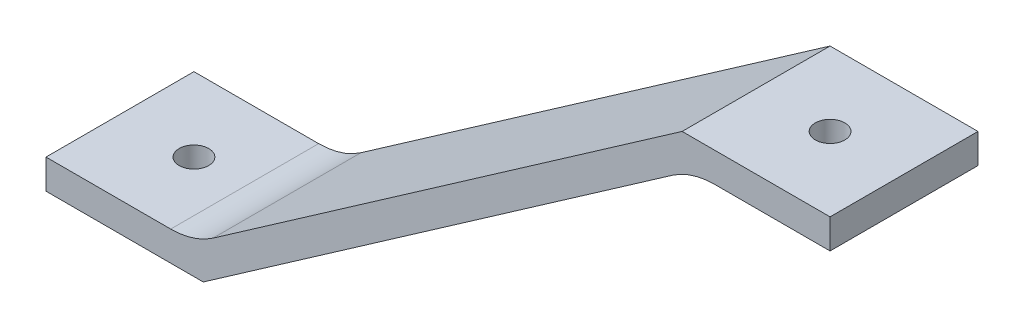
ISO-10303-21;
HEADER;
FILE_DESCRIPTION(('STEP AP214'),'2;1');
FILE_NAME('part.step','',(''),(''),'','','');
FILE_SCHEMA(('AUTOMOTIVE_DESIGN { 1 0 10303 214 1 1 1 1 }'));
ENDSEC;
DATA;
#1=APPLICATION_CONTEXT('core data for automotive mechanical design processes');
#2=APPLICATION_PROTOCOL_DEFINITION('international standard','automotive_design',2000,#1);
#3=PRODUCT_CONTEXT('',#1,'mechanical');
#4=PRODUCT('Part','Part','',(#3));
#5=PRODUCT_RELATED_PRODUCT_CATEGORY('part','',(#4));
#6=PRODUCT_DEFINITION_FORMATION('','',#4);
#7=PRODUCT_DEFINITION_CONTEXT('part definition',#1,'design');
#8=PRODUCT_DEFINITION('design','',#6,#7);
#9=PRODUCT_DEFINITION_SHAPE('','',#8);
#10=(LENGTH_UNIT() NAMED_UNIT(*) SI_UNIT(.MILLI.,.METRE.));
#11=(NAMED_UNIT(*) PLANE_ANGLE_UNIT() SI_UNIT($,.RADIAN.));
#12=(NAMED_UNIT(*) SI_UNIT($,.STERADIAN.) SOLID_ANGLE_UNIT());
#13=UNCERTAINTY_MEASURE_WITH_UNIT(LENGTH_MEASURE(1.E-05),#10,'distance_accuracy_value','');
#14=(GEOMETRIC_REPRESENTATION_CONTEXT(3) GLOBAL_UNCERTAINTY_ASSIGNED_CONTEXT((#13)) GLOBAL_UNIT_ASSIGNED_CONTEXT((#10,
#11,#12)) REPRESENTATION_CONTEXT('',''));
#15=CARTESIAN_POINT('',(0.,0.,0.));
#16=DIRECTION('',(0.,0.,1.));
#17=DIRECTION('',(1.,0.,0.));
#18=AXIS2_PLACEMENT_3D('',#15,#16,#17);
#19=CARTESIAN_POINT('',(-20.,0.,20.));
#20=DIRECTION('',(0.,-1.,0.));
#21=DIRECTION('',(0.,0.,-1.));
#22=AXIS2_PLACEMENT_3D('',#19,#20,#21);
#23=PLANE('',#22);
#24=CARTESIAN_POINT('',(-10.,0.,10.));
#25=DIRECTION('',(0.,1.,0.));
#26=DIRECTION('',(0.,0.,1.));
#27=AXIS2_PLACEMENT_3D('',#24,#25,#26);
#28=CIRCLE('',#27,2.);
#29=CARTESIAN_POINT('',(-10.,0.,12.));
#30=VERTEX_POINT('',#29);
#31=EDGE_CURVE('E148',#30,#30,#28,.T.);
#32=ORIENTED_EDGE('',*,*,#31,.F.);
#33=EDGE_LOOP('',(#32));
#34=FACE_BOUND('',#33,.T.);
#35=DIRECTION('',(-1.,0.,0.));
#36=VECTOR('',#35,1.);
#37=CARTESIAN_POINT('',(-20.,0.,0.));
#38=LINE('',#37,#36);
#39=CARTESIAN_POINT('',(0.,0.,0.));
#40=VERTEX_POINT('',#39);
#41=CARTESIAN_POINT('',(-20.,0.,0.));
#42=VERTEX_POINT('',#41);
#43=EDGE_CURVE('E135',#40,#42,#38,.T.);
#44=ORIENTED_EDGE('',*,*,#43,.T.);
#45=DIRECTION('',(0.,0.,-1.));
#46=VECTOR('',#45,1.);
#47=CARTESIAN_POINT('',(-20.,0.,20.));
#48=LINE('',#47,#46);
#49=CARTESIAN_POINT('',(-20.,0.,20.));
#50=VERTEX_POINT('',#49);
#51=EDGE_CURVE('E116',#50,#42,#48,.T.);
#52=ORIENTED_EDGE('',*,*,#51,.F.);
#53=DIRECTION('',(-1.,0.,0.));
#54=VECTOR('',#53,1.);
#55=CARTESIAN_POINT('',(-20.,0.,20.));
#56=LINE('',#55,#54);
#57=CARTESIAN_POINT('',(0.,0.,20.));
#58=VERTEX_POINT('',#57);
#59=EDGE_CURVE('E123',#58,#50,#56,.T.);
#60=ORIENTED_EDGE('',*,*,#59,.F.);
#61=DIRECTION('',(0.,0.,-1.));
#62=VECTOR('',#61,1.);
#63=CARTESIAN_POINT('',(0.,0.,20.));
#64=LINE('',#63,#62);
#65=EDGE_CURVE('E187',#58,#40,#64,.T.);
#66=ORIENTED_EDGE('',*,*,#65,.T.);
#67=EDGE_LOOP('',(#44,#52,#60,#66));
#68=FACE_BOUND('',#67,.T.);
#69=ADVANCED_FACE('F34',(#34,#68),#23,.F.);
#70=CARTESIAN_POINT('',(-86.,-46.,20.));
#71=DIRECTION('',(0.571792661688173,-0.820398166769987,0.));
#72=DIRECTION('',(0.820398166769987,0.571792661688173,0.));
#73=AXIS2_PLACEMENT_3D('',#70,#71,#72);
#74=PLANE('',#73);
#75=DIRECTION('',(-0.820398166769987,-0.571792661688173,0.));
#76=VECTOR('',#75,1.);
#77=CARTESIAN_POINT('',(-86.,-46.,0.));
#78=LINE('',#77,#76);
#79=CARTESIAN_POINT('',(-83.4231041319172,-44.2039816676998,0.));
#80=VERTEX_POINT('',#79);
#81=EDGE_CURVE('E170',#42,#80,#78,.T.);
#82=ORIENTED_EDGE('',*,*,#81,.T.);
#83=DIRECTION('',(0.,0.,-1.));
#84=VECTOR('',#83,1.);
#85=CARTESIAN_POINT('',(-83.4231041319172,-44.2039816676998,20.));
#86=LINE('',#85,#84);
#87=CARTESIAN_POINT('',(-83.4231041319172,-44.2039816676998,20.));
#88=VERTEX_POINT('',#87);
#89=EDGE_CURVE('E119',#80,#88,#86,.F.);
#90=ORIENTED_EDGE('',*,*,#89,.T.);
#91=DIRECTION('',(-0.820398166769987,-0.571792661688173,0.));
#92=VECTOR('',#91,1.);
#93=CARTESIAN_POINT('',(-86.,-46.,20.));
#94=LINE('',#93,#92);
#95=EDGE_CURVE('E111',#50,#88,#94,.T.);
#96=ORIENTED_EDGE('',*,*,#95,.F.);
#97=ORIENTED_EDGE('',*,*,#51,.T.);
#98=EDGE_LOOP('',(#82,#90,#96,#97));
#99=FACE_BOUND('',#98,.T.);
#100=ADVANCED_FACE('F114',(#99),#74,.F.);
#101=CARTESIAN_POINT('',(-106.,-46.,20.));
#102=DIRECTION('',(0.,-1.,0.));
#103=DIRECTION('',(1.,0.,0.));
#104=AXIS2_PLACEMENT_3D('',#101,#102,#103);
#105=PLANE('',#104);
#106=CARTESIAN_POINT('',(-96.,-46.,10.));
#107=DIRECTION('',(0.,-1.,0.));
#108=DIRECTION('',(1.,0.,0.));
#109=AXIS2_PLACEMENT_3D('',#106,#107,#108);
#110=CIRCLE('',#109,2.);
#111=CARTESIAN_POINT('',(-94.,-46.,10.));
#112=VERTEX_POINT('',#111);
#113=EDGE_CURVE('E220',#112,#112,#110,.T.);
#114=ORIENTED_EDGE('',*,*,#113,.T.);
#115=EDGE_LOOP('',(#114));
#116=FACE_BOUND('',#115,.T.);
#117=DIRECTION('',(-1.,0.,0.));
#118=VECTOR('',#117,1.);
#119=CARTESIAN_POINT('',(-106.,-46.,20.));
#120=LINE('',#119,#118);
#121=CARTESIAN_POINT('',(-89.1410307487989,-46.,20.));
#122=VERTEX_POINT('',#121);
#123=CARTESIAN_POINT('',(-106.,-46.,20.));
#124=VERTEX_POINT('',#123);
#125=EDGE_CURVE('E122',#122,#124,#120,.T.);
#126=ORIENTED_EDGE('',*,*,#125,.F.);
#127=DIRECTION('',(0.,0.,-1.));
#128=VECTOR('',#127,1.);
#129=CARTESIAN_POINT('',(-89.1410307487989,-46.,0.));
#130=LINE('',#129,#128);
#131=CARTESIAN_POINT('',(-89.1410307487989,-46.,0.));
#132=VERTEX_POINT('',#131);
#133=EDGE_CURVE('E136',#122,#132,#130,.T.);
#134=ORIENTED_EDGE('',*,*,#133,.T.);
#135=DIRECTION('',(-1.,0.,0.));
#136=VECTOR('',#135,1.);
#137=CARTESIAN_POINT('',(-106.,-46.,0.));
#138=LINE('',#137,#136);
#139=CARTESIAN_POINT('',(-106.,-46.,0.));
#140=VERTEX_POINT('',#139);
#141=EDGE_CURVE('E172',#132,#140,#138,.T.);
#142=ORIENTED_EDGE('',*,*,#141,.T.);
#143=DIRECTION('',(0.,0.,-1.));
#144=VECTOR('',#143,1.);
#145=CARTESIAN_POINT('',(-106.,-46.,20.));
#146=LINE('',#145,#144);
#147=EDGE_CURVE('E137',#124,#140,#146,.T.);
#148=ORIENTED_EDGE('',*,*,#147,.F.);
#149=EDGE_LOOP('',(#126,#134,#142,#148));
#150=FACE_BOUND('',#149,.T.);
#151=ADVANCED_FACE('F163',(#116,#150),#105,.F.);
#152=CARTESIAN_POINT('',(-106.,-50.,20.));
#153=DIRECTION('',(1.,0.,0.));
#154=DIRECTION('',(0.,1.,0.));
#155=AXIS2_PLACEMENT_3D('',#152,#153,#154);
#156=PLANE('',#155);
#157=DIRECTION('',(0.,-1.,0.));
#158=VECTOR('',#157,1.);
#159=CARTESIAN_POINT('',(-106.,-50.,0.));
#160=LINE('',#159,#158);
#161=CARTESIAN_POINT('',(-106.,-50.,0.));
#162=VERTEX_POINT('',#161);
#163=EDGE_CURVE('E174',#140,#162,#160,.T.);
#164=ORIENTED_EDGE('',*,*,#163,.T.);
#165=DIRECTION('',(0.,0.,-1.));
#166=VECTOR('',#165,1.);
#167=CARTESIAN_POINT('',(-106.,-50.,20.));
#168=LINE('',#167,#166);
#169=CARTESIAN_POINT('',(-106.,-50.,20.));
#170=VERTEX_POINT('',#169);
#171=EDGE_CURVE('E142',#170,#162,#168,.T.);
#172=ORIENTED_EDGE('',*,*,#171,.F.);
#173=DIRECTION('',(0.,-1.,0.));
#174=VECTOR('',#173,1.);
#175=CARTESIAN_POINT('',(-106.,-50.,20.));
#176=LINE('',#175,#174);
#177=EDGE_CURVE('E166',#124,#170,#176,.T.);
#178=ORIENTED_EDGE('',*,*,#177,.F.);
#179=ORIENTED_EDGE('',*,*,#147,.T.);
#180=EDGE_LOOP('',(#164,#172,#178,#179));
#181=FACE_BOUND('',#180,.T.);
#182=ADVANCED_FACE('F231',(#181),#156,.F.);
#183=CARTESIAN_POINT('',(-84.7435877004804,-50.,20.));
#184=DIRECTION('',(0.,1.,0.));
#185=DIRECTION('',(0.,0.,1.));
#186=AXIS2_PLACEMENT_3D('',#183,#184,#185);
#187=PLANE('',#186);
#188=CARTESIAN_POINT('',(-96.,-50.0000000000001,10.));
#189=DIRECTION('',(0.,-1.,0.));
#190=DIRECTION('',(1.,0.,0.));
#191=AXIS2_PLACEMENT_3D('',#188,#189,#190);
#192=CIRCLE('',#191,2.);
#193=CARTESIAN_POINT('',(-94.,-50.0000000000001,10.));
#194=VERTEX_POINT('',#193);
#195=EDGE_CURVE('E223',#194,#194,#192,.T.);
#196=ORIENTED_EDGE('',*,*,#195,.F.);
#197=EDGE_LOOP('',(#196));
#198=FACE_BOUND('',#197,.T.);
#199=DIRECTION('',(1.,0.,0.));
#200=VECTOR('',#199,1.);
#201=CARTESIAN_POINT('',(-84.7435877004804,-50.,0.));
#202=LINE('',#201,#200);
#203=CARTESIAN_POINT('',(-84.7435877004804,-50.,0.));
#204=VERTEX_POINT('',#203);
#205=EDGE_CURVE('E180',#162,#204,#202,.T.);
#206=ORIENTED_EDGE('',*,*,#205,.T.);
#207=DIRECTION('',(0.,0.,-1.));
#208=VECTOR('',#207,1.);
#209=CARTESIAN_POINT('',(-84.7435877004804,-50.,20.));
#210=LINE('',#209,#208);
#211=CARTESIAN_POINT('',(-84.7435877004804,-50.,20.));
#212=VERTEX_POINT('',#211);
#213=EDGE_CURVE('E192',#212,#204,#210,.T.);
#214=ORIENTED_EDGE('',*,*,#213,.F.);
#215=DIRECTION('',(1.,0.,0.));
#216=VECTOR('',#215,1.);
#217=CARTESIAN_POINT('',(-84.7435877004804,-50.,20.));
#218=LINE('',#217,#216);
#219=EDGE_CURVE('E201',#170,#212,#218,.T.);
#220=ORIENTED_EDGE('',*,*,#219,.F.);
#221=ORIENTED_EDGE('',*,*,#171,.T.);
#222=EDGE_LOOP('',(#206,#214,#220,#221));
#223=FACE_BOUND('',#222,.T.);
#224=ADVANCED_FACE('F199',(#198,#223),#187,.F.);
#225=CARTESIAN_POINT('',(-18.7435877004804,-4.,20.));
#226=DIRECTION('',(-0.571792661688173,0.820398166769987,0.));
#227=DIRECTION('',(-0.820398166769987,-0.571792661688173,0.));
#228=AXIS2_PLACEMENT_3D('',#225,#226,#227);
#229=PLANE('',#228);
#230=DIRECTION('',(0.820398166769987,0.571792661688173,0.));
#231=VECTOR('',#230,1.);
#232=CARTESIAN_POINT('',(-18.7435877004804,-4.,0.));
#233=LINE('',#232,#231);
#234=CARTESIAN_POINT('',(-21.3204835685632,-5.79601833230014,0.));
#235=VERTEX_POINT('',#234);
#236=EDGE_CURVE('E182',#204,#235,#233,.T.);
#237=ORIENTED_EDGE('',*,*,#236,.T.);
#238=DIRECTION('',(0.,0.,-1.));
#239=VECTOR('',#238,1.);
#240=CARTESIAN_POINT('',(-21.3204835685632,-5.79601833230014,20.));
#241=LINE('',#240,#239);
#242=CARTESIAN_POINT('',(-21.3204835685632,-5.79601833230014,20.));
#243=VERTEX_POINT('',#242);
#244=EDGE_CURVE('E49',#235,#243,#241,.F.);
#245=ORIENTED_EDGE('',*,*,#244,.T.);
#246=DIRECTION('',(0.820398166769987,0.571792661688173,0.));
#247=VECTOR('',#246,1.);
#248=CARTESIAN_POINT('',(-18.7435877004804,-4.,20.));
#249=LINE('',#248,#247);
#250=EDGE_CURVE('E210',#212,#243,#249,.T.);
#251=ORIENTED_EDGE('',*,*,#250,.F.);
#252=ORIENTED_EDGE('',*,*,#213,.T.);
#253=EDGE_LOOP('',(#237,#245,#251,#252));
#254=FACE_BOUND('',#253,.T.);
#255=ADVANCED_FACE('F203',(#254),#229,.F.);
#256=CARTESIAN_POINT('',(0.,-4.,20.));
#257=DIRECTION('',(0.,1.,0.));
#258=DIRECTION('',(-1.,0.,0.));
#259=AXIS2_PLACEMENT_3D('',#256,#257,#258);
#260=PLANE('',#259);
#261=CARTESIAN_POINT('',(-10.,-4.,10.));
#262=DIRECTION('',(0.,1.,0.));
#263=DIRECTION('',(-1.,0.,0.));
#264=AXIS2_PLACEMENT_3D('',#261,#262,#263);
#265=CIRCLE('',#264,2.);
#266=CARTESIAN_POINT('',(-12.,-4.,10.));
#267=VERTEX_POINT('',#266);
#268=EDGE_CURVE('E146',#267,#267,#265,.T.);
#269=ORIENTED_EDGE('',*,*,#268,.T.);
#270=EDGE_LOOP('',(#269));
#271=FACE_BOUND('',#270,.T.);
#272=DIRECTION('',(1.,0.,0.));
#273=VECTOR('',#272,1.);
#274=CARTESIAN_POINT('',(0.,-4.,20.));
#275=LINE('',#274,#273);
#276=CARTESIAN_POINT('',(-15.6025569516815,-4.,20.));
#277=VERTEX_POINT('',#276);
#278=CARTESIAN_POINT('',(0.,-4.,20.));
#279=VERTEX_POINT('',#278);
#280=EDGE_CURVE('E208',#277,#279,#275,.T.);
#281=ORIENTED_EDGE('',*,*,#280,.F.);
#282=DIRECTION('',(0.,0.,-1.));
#283=VECTOR('',#282,1.);
#284=CARTESIAN_POINT('',(-15.6025569516815,-4.,0.));
#285=LINE('',#284,#283);
#286=CARTESIAN_POINT('',(-15.6025569516815,-4.,0.));
#287=VERTEX_POINT('',#286);
#288=EDGE_CURVE('E151',#277,#287,#285,.T.);
#289=ORIENTED_EDGE('',*,*,#288,.T.);
#290=DIRECTION('',(1.,0.,0.));
#291=VECTOR('',#290,1.);
#292=CARTESIAN_POINT('',(0.,-4.,0.));
#293=LINE('',#292,#291);
#294=CARTESIAN_POINT('',(0.,-4.,0.));
#295=VERTEX_POINT('',#294);
#296=EDGE_CURVE('E184',#287,#295,#293,.T.);
#297=ORIENTED_EDGE('',*,*,#296,.T.);
#298=DIRECTION('',(0.,0.,-1.));
#299=VECTOR('',#298,1.);
#300=CARTESIAN_POINT('',(0.,-4.,20.));
#301=LINE('',#300,#299);
#302=EDGE_CURVE('E189',#279,#295,#301,.T.);
#303=ORIENTED_EDGE('',*,*,#302,.F.);
#304=EDGE_LOOP('',(#281,#289,#297,#303));
#305=FACE_BOUND('',#304,.T.);
#306=ADVANCED_FACE('F212',(#271,#305),#260,.F.);
#307=CARTESIAN_POINT('',(0.,0.,20.));
#308=DIRECTION('',(-1.,0.,0.));
#309=DIRECTION('',(0.,-1.,0.));
#310=AXIS2_PLACEMENT_3D('',#307,#308,#309);
#311=PLANE('',#310);
#312=DIRECTION('',(0.,1.,0.));
#313=VECTOR('',#312,1.);
#314=CARTESIAN_POINT('',(0.,0.,0.));
#315=LINE('',#314,#313);
#316=EDGE_CURVE('E132',#295,#40,#315,.T.);
#317=ORIENTED_EDGE('',*,*,#316,.T.);
#318=ORIENTED_EDGE('',*,*,#65,.F.);
#319=DIRECTION('',(0.,1.,0.));
#320=VECTOR('',#319,1.);
#321=CARTESIAN_POINT('',(0.,0.,20.));
#322=LINE('',#321,#320);
#323=EDGE_CURVE('E128',#279,#58,#322,.T.);
#324=ORIENTED_EDGE('',*,*,#323,.F.);
#325=ORIENTED_EDGE('',*,*,#302,.T.);
#326=EDGE_LOOP('',(#317,#318,#324,#325));
#327=FACE_BOUND('',#326,.T.);
#328=ADVANCED_FACE('F263',(#327),#311,.F.);
#329=CARTESIAN_POINT('',(0.,0.,20.));
#330=DIRECTION('',(0.,0.,-1.));
#331=DIRECTION('',(-1.,0.,0.));
#332=AXIS2_PLACEMENT_3D('',#329,#330,#331);
#333=PLANE('',#332);
#334=ORIENTED_EDGE('',*,*,#59,.T.);
#335=ORIENTED_EDGE('',*,*,#95,.T.);
#336=CARTESIAN_POINT('',(-89.1410307487989,-36.,20.));
#337=DIRECTION('',(0.,0.,-1.));
#338=DIRECTION('',(-1.,0.,0.));
#339=AXIS2_PLACEMENT_3D('',#336,#337,#338);
#340=CIRCLE('',#339,10.);
#341=EDGE_CURVE('E157',#88,#122,#340,.T.);
#342=ORIENTED_EDGE('',*,*,#341,.T.);
#343=ORIENTED_EDGE('',*,*,#125,.T.);
#344=ORIENTED_EDGE('',*,*,#177,.T.);
#345=ORIENTED_EDGE('',*,*,#219,.T.);
#346=ORIENTED_EDGE('',*,*,#250,.T.);
#347=CARTESIAN_POINT('',(-15.6025569516815,-14.,20.));
#348=DIRECTION('',(0.,0.,-1.));
#349=DIRECTION('',(-1.,0.,0.));
#350=AXIS2_PLACEMENT_3D('',#347,#348,#349);
#351=CIRCLE('',#350,10.);
#352=EDGE_CURVE('E11',#243,#277,#351,.T.);
#353=ORIENTED_EDGE('',*,*,#352,.T.);
#354=ORIENTED_EDGE('',*,*,#280,.T.);
#355=ORIENTED_EDGE('',*,*,#323,.T.);
#356=EDGE_LOOP('',(#334,#335,#342,#343,#344,#345,#346,#353,#354,#355));
#357=FACE_BOUND('',#356,.T.);
#358=ADVANCED_FACE('F126',(#357),#333,.F.);
#359=CARTESIAN_POINT('',(0.,0.,0.));
#360=DIRECTION('',(0.,0.,-1.));
#361=DIRECTION('',(-1.,0.,0.));
#362=AXIS2_PLACEMENT_3D('',#359,#360,#361);
#363=PLANE('',#362);
#364=ORIENTED_EDGE('',*,*,#43,.F.);
#365=ORIENTED_EDGE('',*,*,#316,.F.);
#366=ORIENTED_EDGE('',*,*,#296,.F.);
#367=CARTESIAN_POINT('',(-15.6025569516815,-14.,0.));
#368=DIRECTION('',(0.,0.,-1.));
#369=DIRECTION('',(-1.,0.,0.));
#370=AXIS2_PLACEMENT_3D('',#367,#368,#369);
#371=CIRCLE('',#370,10.);
#372=EDGE_CURVE('E42',#287,#235,#371,.F.);
#373=ORIENTED_EDGE('',*,*,#372,.T.);
#374=ORIENTED_EDGE('',*,*,#236,.F.);
#375=ORIENTED_EDGE('',*,*,#205,.F.);
#376=ORIENTED_EDGE('',*,*,#163,.F.);
#377=ORIENTED_EDGE('',*,*,#141,.F.);
#378=CARTESIAN_POINT('',(-89.1410307487989,-36.,0.));
#379=DIRECTION('',(0.,0.,-1.));
#380=DIRECTION('',(-1.,0.,0.));
#381=AXIS2_PLACEMENT_3D('',#378,#379,#380);
#382=CIRCLE('',#381,10.);
#383=EDGE_CURVE('E155',#132,#80,#382,.F.);
#384=ORIENTED_EDGE('',*,*,#383,.T.);
#385=ORIENTED_EDGE('',*,*,#81,.F.);
#386=EDGE_LOOP('',(#364,#365,#366,#373,#374,#375,#376,#377,#384,#385));
#387=FACE_BOUND('',#386,.T.);
#388=ADVANCED_FACE('F169',(#387),#363,.T.);
#389=CARTESIAN_POINT('',(-10.,-50.,10.));
#390=DIRECTION('',(0.,1.,0.));
#391=DIRECTION('',(0.,0.,1.));
#392=AXIS2_PLACEMENT_3D('',#389,#390,#391);
#393=CYLINDRICAL_SURFACE('',#392,2.);
#394=ORIENTED_EDGE('',*,*,#31,.T.);
#395=EDGE_LOOP('',(#394));
#396=FACE_BOUND('',#395,.T.);
#397=ORIENTED_EDGE('',*,*,#268,.F.);
#398=EDGE_LOOP('',(#397));
#399=FACE_BOUND('',#398,.T.);
#400=ADVANCED_FACE('F253',(#396,#399),#393,.F.);
#401=CARTESIAN_POINT('',(-96.,0.,10.));
#402=DIRECTION('',(0.,-1.,0.));
#403=DIRECTION('',(1.,0.,0.));
#404=AXIS2_PLACEMENT_3D('',#401,#402,#403);
#405=CYLINDRICAL_SURFACE('',#404,2.);
#406=ORIENTED_EDGE('',*,*,#195,.T.);
#407=EDGE_LOOP('',(#406));
#408=FACE_BOUND('',#407,.T.);
#409=ORIENTED_EDGE('',*,*,#113,.F.);
#410=EDGE_LOOP('',(#409));
#411=FACE_BOUND('',#410,.T.);
#412=ADVANCED_FACE('F227',(#408,#411),#405,.F.);
#413=CARTESIAN_POINT('',(-89.1410307487989,-36.,20.));
#414=DIRECTION('',(0.,0.,1.));
#415=DIRECTION('',(1.,0.,0.));
#416=AXIS2_PLACEMENT_3D('',#413,#414,#415);
#417=CYLINDRICAL_SURFACE('',#416,10.);
#418=ORIENTED_EDGE('',*,*,#341,.F.);
#419=ORIENTED_EDGE('',*,*,#89,.F.);
#420=ORIENTED_EDGE('',*,*,#383,.F.);
#421=ORIENTED_EDGE('',*,*,#133,.F.);
#422=EDGE_LOOP('',(#418,#419,#420,#421));
#423=FACE_BOUND('',#422,.T.);
#424=ADVANCED_FACE('F168',(#423),#417,.F.);
#425=CARTESIAN_POINT('',(-15.6025569516815,-14.,20.));
#426=DIRECTION('',(0.,0.,1.));
#427=DIRECTION('',(1.,0.,0.));
#428=AXIS2_PLACEMENT_3D('',#425,#426,#427);
#429=CYLINDRICAL_SURFACE('',#428,10.);
#430=ORIENTED_EDGE('',*,*,#352,.F.);
#431=ORIENTED_EDGE('',*,*,#244,.F.);
#432=ORIENTED_EDGE('',*,*,#372,.F.);
#433=ORIENTED_EDGE('',*,*,#288,.F.);
#434=EDGE_LOOP('',(#430,#431,#432,#433));
#435=FACE_BOUND('',#434,.T.);
#436=ADVANCED_FACE('F36',(#435),#429,.F.);
#437=CLOSED_SHELL('',(#69,#100,#151,#182,#224,#255,#306,#328,#358,#388,#400,#412,#424,#436));
#438=MANIFOLD_SOLID_BREP('B2',#437);
#439=ADVANCED_BREP_SHAPE_REPRESENTATION('',(#18,#438),#14);
#440=SHAPE_DEFINITION_REPRESENTATION(#9,#439);
ENDSEC;
END-ISO-10303-21;
